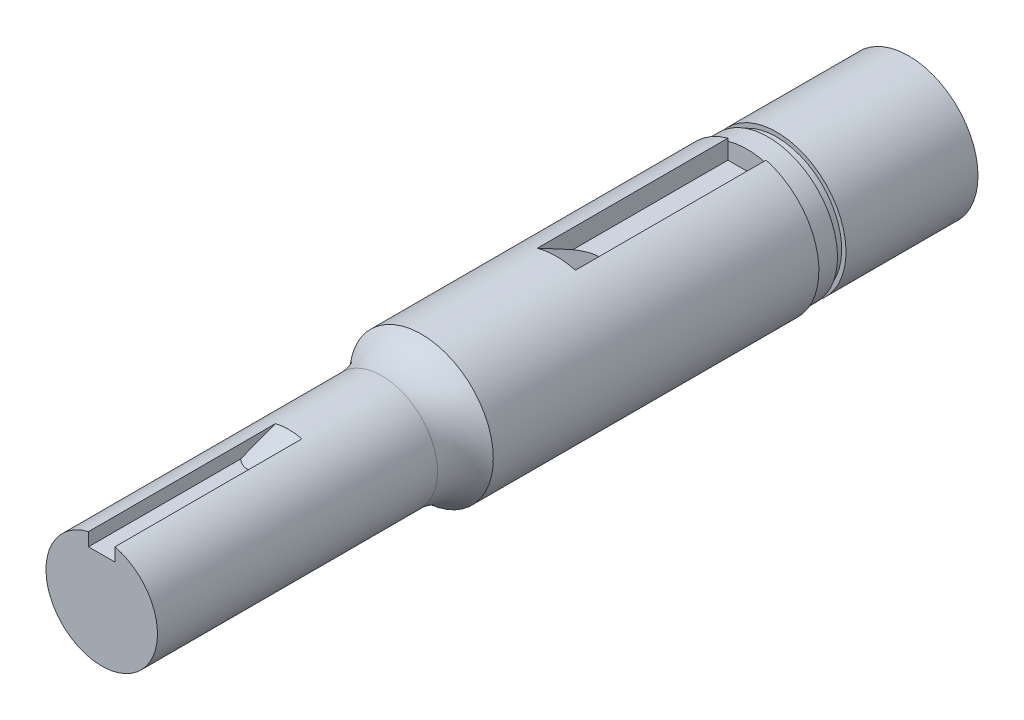
ISO-10303-21;
HEADER;
FILE_DESCRIPTION(('STEP AP214'),'2;1');
FILE_NAME('part.step','',(''),(''),'','','');
FILE_SCHEMA(('AUTOMOTIVE_DESIGN { 1 0 10303 214 1 1 1 1 }'));
ENDSEC;
DATA;
#1=APPLICATION_CONTEXT('core data for automotive mechanical design processes');
#2=APPLICATION_PROTOCOL_DEFINITION('international standard','automotive_design',2000,#1);
#3=PRODUCT_CONTEXT('',#1,'mechanical');
#4=PRODUCT('Part','Part','',(#3));
#5=PRODUCT_RELATED_PRODUCT_CATEGORY('part','',(#4));
#6=PRODUCT_DEFINITION_FORMATION('','',#4);
#7=PRODUCT_DEFINITION_CONTEXT('part definition',#1,'design');
#8=PRODUCT_DEFINITION('design','',#6,#7);
#9=PRODUCT_DEFINITION_SHAPE('','',#8);
#10=(LENGTH_UNIT() NAMED_UNIT(*) SI_UNIT(.MILLI.,.METRE.));
#11=(NAMED_UNIT(*) PLANE_ANGLE_UNIT() SI_UNIT($,.RADIAN.));
#12=(NAMED_UNIT(*) SI_UNIT($,.STERADIAN.) SOLID_ANGLE_UNIT());
#13=UNCERTAINTY_MEASURE_WITH_UNIT(LENGTH_MEASURE(1.E-05),#10,'distance_accuracy_value','');
#14=(GEOMETRIC_REPRESENTATION_CONTEXT(3) GLOBAL_UNCERTAINTY_ASSIGNED_CONTEXT((#13)) GLOBAL_UNIT_ASSIGNED_CONTEXT((#10,
#11,#12)) REPRESENTATION_CONTEXT('',''));
#15=CARTESIAN_POINT('',(0.,0.,0.));
#16=DIRECTION('',(0.,0.,1.));
#17=DIRECTION('',(1.,0.,0.));
#18=AXIS2_PLACEMENT_3D('',#15,#16,#17);
#19=CARTESIAN_POINT('',(0.,0.,28.194));
#20=DIRECTION('',(0.,0.,-1.));
#21=DIRECTION('',(-1.,0.,0.));
#22=AXIS2_PLACEMENT_3D('',#19,#20,#21);
#23=CYLINDRICAL_SURFACE('',#22,6.223);
#24=DIRECTION('',(0.,0.,-1.));
#25=VECTOR('',#24,1.);
#26=CARTESIAN_POINT('',(1.651,5.999993999997,28.194));
#27=LINE('',#26,#25);
#28=CARTESIAN_POINT('',(1.651,5.999993999997,0.));
#29=VERTEX_POINT('',#28);
#30=CARTESIAN_POINT('',(1.651,5.999993999997,16.51));
#31=VERTEX_POINT('',#30);
#32=EDGE_CURVE('E173',#29,#31,#27,.F.);
#33=ORIENTED_EDGE('',*,*,#32,.T.);
#34=CARTESIAN_POINT('',(0.,0.,16.51));
#35=DIRECTION('',(0.,0.,-1.));
#36=DIRECTION('',(-1.,0.,0.));
#37=AXIS2_PLACEMENT_3D('',#34,#35,#36);
#38=CIRCLE('',#37,6.223);
#39=CARTESIAN_POINT('',(-1.651,5.999993999997,16.51));
#40=VERTEX_POINT('',#39);
#41=EDGE_CURVE('E309',#31,#40,#38,.F.);
#42=ORIENTED_EDGE('',*,*,#41,.T.);
#43=DIRECTION('',(0.,0.,-1.));
#44=VECTOR('',#43,1.);
#45=CARTESIAN_POINT('',(-1.651,5.999993999997,28.194));
#46=LINE('',#45,#44);
#47=CARTESIAN_POINT('',(-1.651,5.999993999997,0.));
#48=VERTEX_POINT('',#47);
#49=EDGE_CURVE('E170',#40,#48,#46,.T.);
#50=ORIENTED_EDGE('',*,*,#49,.T.);
#51=CARTESIAN_POINT('',(0.,0.,0.));
#52=DIRECTION('',(0.,0.,1.));
#53=DIRECTION('',(1.,0.,0.));
#54=AXIS2_PLACEMENT_3D('',#51,#52,#53);
#55=CIRCLE('',#54,6.223);
#56=EDGE_CURVE('E128',#48,#29,#55,.T.);
#57=ORIENTED_EDGE('',*,*,#56,.T.);
#58=EDGE_LOOP('',(#33,#42,#50,#57));
#59=FACE_BOUND('',#58,.T.);
#60=CARTESIAN_POINT('',(0.,0.,28.194));
#61=DIRECTION('',(0.,0.,1.));
#62=DIRECTION('',(1.,0.,0.));
#63=AXIS2_PLACEMENT_3D('',#60,#61,#62);
#64=CIRCLE('',#63,6.223);
#65=CARTESIAN_POINT('',(6.223,0.,28.194));
#66=VERTEX_POINT('',#65);
#67=EDGE_CURVE('E182',#66,#66,#64,.T.);
#68=ORIENTED_EDGE('',*,*,#67,.F.);
#69=EDGE_LOOP('',(#68));
#70=FACE_BOUND('',#69,.T.);
#71=ADVANCED_FACE('F35',(#59,#70),#23,.T.);
#72=CARTESIAN_POINT('',(0.,0.,0.));
#73=DIRECTION('',(0.,0.,1.));
#74=DIRECTION('',(1.,0.,0.));
#75=AXIS2_PLACEMENT_3D('',#72,#73,#74);
#76=PLANE('',#75);
#77=CARTESIAN_POINT('',(0.,0.,0.));
#78=DIRECTION('',(0.,0.,-1.));
#79=DIRECTION('',(0.,1.,0.));
#80=AXIS2_PLACEMENT_3D('',#77,#78,#79);
#81=CIRCLE('',#80,6.);
#82=CARTESIAN_POINT('',(1.651,5.76837923510582,0.));
#83=VERTEX_POINT('',#82);
#84=CARTESIAN_POINT('',(-1.651,5.76837923510582,0.));
#85=VERTEX_POINT('',#84);
#86=EDGE_CURVE('E125',#83,#85,#81,.T.);
#87=ORIENTED_EDGE('',*,*,#86,.F.);
#88=DIRECTION('',(0.,-1.,0.));
#89=VECTOR('',#88,1.);
#90=CARTESIAN_POINT('',(1.651,7.650993999997,0.));
#91=LINE('',#90,#89);
#92=EDGE_CURVE('E166',#29,#83,#91,.T.);
#93=ORIENTED_EDGE('',*,*,#92,.F.);
#94=ORIENTED_EDGE('',*,*,#56,.F.);
#95=DIRECTION('',(0.,1.,0.));
#96=VECTOR('',#95,1.);
#97=CARTESIAN_POINT('',(-1.651,7.650993999997,0.));
#98=LINE('',#97,#96);
#99=EDGE_CURVE('E115',#85,#48,#98,.T.);
#100=ORIENTED_EDGE('',*,*,#99,.F.);
#101=EDGE_LOOP('',(#87,#93,#94,#100));
#102=FACE_BOUND('',#101,.T.);
#103=ADVANCED_FACE('F122',(#102),#76,.F.);
#104=CARTESIAN_POINT('',(0.,0.,23.114));
#105=DIRECTION('',(0.,0.,1.));
#106=DIRECTION('',(1.,0.,0.));
#107=AXIS2_PLACEMENT_3D('',#104,#105,#106);
#108=CYLINDRICAL_SURFACE('',#107,4.826);
#109=CARTESIAN_POINT('',(0.,0.,31.6283661715082));
#110=DIRECTION('',(0.,0.,-1.));
#111=DIRECTION('',(-1.,0.,0.));
#112=AXIS2_PLACEMENT_3D('',#109,#110,#111);
#113=CIRCLE('',#112,4.826);
#114=CARTESIAN_POINT('',(-4.826,0.,31.6283661715082));
#115=VERTEX_POINT('',#114);
#116=EDGE_CURVE('E11',#115,#115,#113,.F.);
#117=ORIENTED_EDGE('',*,*,#116,.T.);
#118=EDGE_LOOP('',(#117));
#119=FACE_BOUND('',#118,.T.);
#120=CARTESIAN_POINT('',(0.,0.,39.6907036772926));
#121=DIRECTION('',(0.,0.,1.));
#122=DIRECTION('',(1.,0.,0.));
#123=AXIS2_PLACEMENT_3D('',#120,#121,#122);
#124=CIRCLE('',#123,4.826);
#125=CARTESIAN_POINT('',(-1.143,4.68869139526158,39.6907036772926));
#126=VERTEX_POINT('',#125);
#127=CARTESIAN_POINT('',(1.143,4.68869139526158,39.6907036772926));
#128=VERTEX_POINT('',#127);
#129=EDGE_CURVE('E185',#126,#128,#124,.F.);
#130=ORIENTED_EDGE('',*,*,#129,.T.);
#131=DIRECTION('',(0.,0.,1.));
#132=VECTOR('',#131,1.);
#133=CARTESIAN_POINT('',(1.143,4.68869139526158,23.114));
#134=LINE('',#133,#132);
#135=CARTESIAN_POINT('',(1.143,4.68869139526158,55.88));
#136=VERTEX_POINT('',#135);
#137=EDGE_CURVE('E175',#136,#128,#134,.F.);
#138=ORIENTED_EDGE('',*,*,#137,.F.);
#139=CARTESIAN_POINT('',(0.,0.,55.88));
#140=DIRECTION('',(0.,0.,1.));
#141=DIRECTION('',(1.,0.,0.));
#142=AXIS2_PLACEMENT_3D('',#139,#140,#141);
#143=CIRCLE('',#142,4.826);
#144=CARTESIAN_POINT('',(-1.143,4.68869139526158,55.88));
#145=VERTEX_POINT('',#144);
#146=EDGE_CURVE('E179',#145,#136,#143,.T.);
#147=ORIENTED_EDGE('',*,*,#146,.F.);
#148=DIRECTION('',(0.,0.,1.));
#149=VECTOR('',#148,1.);
#150=CARTESIAN_POINT('',(-1.143,4.68869139526158,23.114));
#151=LINE('',#150,#149);
#152=EDGE_CURVE('E177',#126,#145,#151,.T.);
#153=ORIENTED_EDGE('',*,*,#152,.F.);
#154=EDGE_LOOP('',(#130,#138,#147,#153));
#155=FACE_BOUND('',#154,.T.);
#156=ADVANCED_FACE('F276',(#119,#155),#108,.T.);
#157=CARTESIAN_POINT('',(0.,0.,55.88));
#158=DIRECTION('',(0.,0.,1.));
#159=DIRECTION('',(1.,0.,0.));
#160=AXIS2_PLACEMENT_3D('',#157,#158,#159);
#161=PLANE('',#160);
#162=DIRECTION('',(0.,-1.,0.));
#163=VECTOR('',#162,1.);
#164=CARTESIAN_POINT('',(-1.143,5.83169139526158,55.88));
#165=LINE('',#164,#163);
#166=CARTESIAN_POINT('',(-1.143,3.54569139526158,55.88));
#167=VERTEX_POINT('',#166);
#168=EDGE_CURVE('E142',#145,#167,#165,.T.);
#169=ORIENTED_EDGE('',*,*,#168,.F.);
#170=ORIENTED_EDGE('',*,*,#146,.T.);
#171=DIRECTION('',(0.,1.,0.));
#172=VECTOR('',#171,1.);
#173=CARTESIAN_POINT('',(1.143,5.83169139526158,55.88));
#174=LINE('',#173,#172);
#175=CARTESIAN_POINT('',(1.143,3.54569139526158,55.88));
#176=VERTEX_POINT('',#175);
#177=EDGE_CURVE('E156',#176,#136,#174,.T.);
#178=ORIENTED_EDGE('',*,*,#177,.F.);
#179=DIRECTION('',(1.,0.,0.));
#180=VECTOR('',#179,1.);
#181=CARTESIAN_POINT('',(-1.143,3.54569139526158,55.88));
#182=LINE('',#181,#180);
#183=EDGE_CURVE('E159',#167,#176,#182,.T.);
#184=ORIENTED_EDGE('',*,*,#183,.F.);
#185=EDGE_LOOP('',(#169,#170,#178,#184));
#186=FACE_BOUND('',#185,.T.);
#187=ADVANCED_FACE('F273',(#186),#161,.T.);
#188=CARTESIAN_POINT('',(1.651,7.650993999997,12.7));
#189=DIRECTION('',(1.,0.,0.));
#190=DIRECTION('',(0.,0.,-1.));
#191=AXIS2_PLACEMENT_3D('',#188,#189,#190);
#192=PLANE('',#191);
#193=ORIENTED_EDGE('',*,*,#92,.T.);
#194=CARTESIAN_POINT('',(1.651,4.348993999997,0.));
#195=VERTEX_POINT('',#194);
#196=EDGE_CURVE('E135',#83,#195,#91,.T.);
#197=ORIENTED_EDGE('',*,*,#196,.T.);
#198=DIRECTION('',(0.,0.,-1.));
#199=VECTOR('',#198,1.);
#200=CARTESIAN_POINT('',(1.651,4.348993999997,12.7));
#201=LINE('',#200,#199);
#202=CARTESIAN_POINT('',(1.651,4.348993999997,13.4264110454169));
#203=VERTEX_POINT('',#202);
#204=EDGE_CURVE('E58',#203,#195,#201,.T.);
#205=ORIENTED_EDGE('',*,*,#204,.F.);
#206=CARTESIAN_POINT('',(1.651,4.348993999997,13.4264110454169));
#207=CARTESIAN_POINT('',(1.651,4.48846788733076,13.6823609357202));
#208=CARTESIAN_POINT('',(1.651,4.62732177659754,13.9386473205925));
#209=CARTESIAN_POINT('',(1.651,4.90402064332714,14.4517610579769));
#210=CARTESIAN_POINT('',(1.651,5.04186563080066,14.7085884050888));
#211=CARTESIAN_POINT('',(1.651,5.31677999377512,15.2226561142071));
#212=CARTESIAN_POINT('',(1.651,5.45384937235951,15.4798964745663));
#213=CARTESIAN_POINT('',(1.651,5.72735836693969,15.9947151032893));
#214=CARTESIAN_POINT('',(1.651,5.86379797670863,16.2522933749619));
#215=CARTESIAN_POINT('',(1.651,5.99999399999702,16.51));
#216=B_SPLINE_CURVE_WITH_KNOTS('',3,(#206,#207,#208,#209,#210,#211,#212,#213,#214,#215),
.UNSPECIFIED.,.F.,.F.,(4,2,2,2,4),(0.,0.874451443988116,1.74889419954307,2.62333347629737,
3.49778138066095),.UNSPECIFIED.);
#217=EDGE_CURVE('E259',#203,#31,#216,.T.);
#218=ORIENTED_EDGE('',*,*,#217,.T.);
#219=ORIENTED_EDGE('',*,*,#32,.F.);
#220=EDGE_LOOP('',(#193,#197,#205,#218,#219));
#221=FACE_BOUND('',#220,.T.);
#222=ADVANCED_FACE('F251',(#221),#192,.F.);
#223=CARTESIAN_POINT('',(-1.651,7.650993999997,12.7));
#224=DIRECTION('',(-1.,0.,0.));
#225=DIRECTION('',(0.,-1.,0.));
#226=AXIS2_PLACEMENT_3D('',#223,#224,#225);
#227=PLANE('',#226);
#228=ORIENTED_EDGE('',*,*,#49,.F.);
#229=CARTESIAN_POINT('',(-1.651,5.999993999997,16.51));
#230=CARTESIAN_POINT('',(-1.651,5.86379797670861,16.2522933749619));
#231=CARTESIAN_POINT('',(-1.651,5.72735836693969,15.9947151032893));
#232=CARTESIAN_POINT('',(-1.651,5.45384937235951,15.4798964745663));
#233=CARTESIAN_POINT('',(-1.651,5.31677999377513,15.2226561142071));
#234=CARTESIAN_POINT('',(-1.651,5.04186563080065,14.7085884050888));
#235=CARTESIAN_POINT('',(-1.651,4.90402064332713,14.4517610579769));
#236=CARTESIAN_POINT('',(-1.651,4.62732177659755,13.9386473205924));
#237=CARTESIAN_POINT('',(-1.651,4.4884678873308,13.6823609357202));
#238=CARTESIAN_POINT('',(-1.651,4.34899399999711,13.4264110454168));
#239=B_SPLINE_CURVE_WITH_KNOTS('',3,(#229,#230,#231,#232,#233,#234,#235,#236,#237,#238),
.UNSPECIFIED.,.F.,.F.,(4,2,2,2,4),(0.,0.874447904363581,1.74888718111788,2.62332993667283,
3.49778138066095),.UNSPECIFIED.);
#240=CARTESIAN_POINT('',(-1.651,4.348993999997,13.4264110454169));
#241=VERTEX_POINT('',#240);
#242=EDGE_CURVE('E43',#40,#241,#239,.T.);
#243=ORIENTED_EDGE('',*,*,#242,.T.);
#244=DIRECTION('',(0.,0.,-1.));
#245=VECTOR('',#244,1.);
#246=CARTESIAN_POINT('',(-1.651,4.348993999997,12.7));
#247=LINE('',#246,#245);
#248=CARTESIAN_POINT('',(-1.651,4.348993999997,0.));
#249=VERTEX_POINT('',#248);
#250=EDGE_CURVE('E50',#241,#249,#247,.T.);
#251=ORIENTED_EDGE('',*,*,#250,.T.);
#252=EDGE_CURVE('E112',#249,#85,#98,.T.);
#253=ORIENTED_EDGE('',*,*,#252,.T.);
#254=ORIENTED_EDGE('',*,*,#99,.T.);
#255=EDGE_LOOP('',(#228,#243,#251,#253,#254));
#256=FACE_BOUND('',#255,.T.);
#257=ADVANCED_FACE('F114',(#256),#227,.F.);
#258=CARTESIAN_POINT('',(1.651,4.348993999997,12.7));
#259=DIRECTION('',(0.,-1.,0.));
#260=DIRECTION('',(1.,0.,0.));
#261=AXIS2_PLACEMENT_3D('',#258,#259,#260);
#262=PLANE('',#261);
#263=DIRECTION('',(-1.,0.,0.));
#264=VECTOR('',#263,1.);
#265=CARTESIAN_POINT('',(1.651,4.348993999997,0.));
#266=LINE('',#265,#264);
#267=EDGE_CURVE('E130',#195,#249,#266,.T.);
#268=ORIENTED_EDGE('',*,*,#267,.T.);
#269=ORIENTED_EDGE('',*,*,#250,.F.);
#270=CARTESIAN_POINT('',(-1.651,4.348993999997,13.4264110454169));
#271=CARTESIAN_POINT('',(-1.58225453370753,4.348993999997,13.3785523534828));
#272=CARTESIAN_POINT('',(-1.51231347373836,4.348993999997,13.3324238638544));
#273=CARTESIAN_POINT('',(-1.36963767788203,4.348993999997,13.2443331821572));
#274=CARTESIAN_POINT('',(-1.29689677320872,4.348993999997,13.2023810176708));
#275=CARTESIAN_POINT('',(-1.07272320173922,4.348993999997,13.0833115356545));
#276=CARTESIAN_POINT('',(-0.916849121790067,4.348993999997,13.0140773063389));
#277=CARTESIAN_POINT('',(-0.63076934235147,4.348993999997,12.9179997481844));
#278=CARTESIAN_POINT('',(-0.502643413856108,4.348993999997,12.8851326076442));
#279=CARTESIAN_POINT('',(-0.308073905823448,4.348993999997,12.8525036538333));
#280=CARTESIAN_POINT('',(-0.242982998479485,4.348993999997,12.8444055771709));
#281=CARTESIAN_POINT('',(-0.112353616722489,4.348993999997,12.8339458488045));
#282=CARTESIAN_POINT('',(-0.0468153150572626,4.348993999997,12.8315820961202));
#283=CARTESIAN_POINT('',(0.0899279452130216,4.348993999997,12.8327361991778));
#284=CARTESIAN_POINT('',(0.161128830405412,4.348993999997,12.8367847552696));
#285=CARTESIAN_POINT('',(0.302873778504621,4.348993999997,12.85160018547));
#286=CARTESIAN_POINT('',(0.373417248307868,4.348993999997,12.8623726233864));
#287=CARTESIAN_POINT('',(0.53261524001256,4.348993999997,12.8940616858492));
#288=CARTESIAN_POINT('',(0.62087652198538,4.348993999997,12.9169611478853));
#289=CARTESIAN_POINT('',(0.794623208606191,4.348993999997,12.9717241484514));
#290=CARTESIAN_POINT('',(0.880105487169831,4.348993999997,13.0035974171479));
#291=CARTESIAN_POINT('',(1.04812252161062,4.348993999997,13.0749551470513));
#292=CARTESIAN_POINT('',(1.13064671680426,4.348993999997,13.1144641734151));
#293=CARTESIAN_POINT('',(1.29237453567966,4.348993999997,13.1996420180998));
#294=CARTESIAN_POINT('',(1.37157973832689,4.348993999997,13.2453078627688));
#295=CARTESIAN_POINT('',(1.4835146191288,4.348993999997,13.314759311475));
#296=CARTESIAN_POINT('',(1.51751402415629,4.348993999997,13.3365340249646));
#297=CARTESIAN_POINT('',(1.58476707570861,4.348993999997,13.3808773862698));
#298=CARTESIAN_POINT('',(1.61802343564025,4.348993999997,13.4034419158464));
#299=CARTESIAN_POINT('',(1.65100000000007,4.348993999997,13.4264110454167));
#300=B_SPLINE_CURVE_WITH_KNOTS('',3,(#270,#271,#272,#273,#274,#275,#276,#277,#278,#279,#280,
#281,#282,#283,#284,#285,#286,#287,#288,#289,#290,#291,#292,#293,#294,#295,#296,#297,#298,#299),
.UNSPECIFIED.,.F.,.F.,(4,2,2,2,2,2,2,2,2,2,2,2,2,2,4),(0.,0.251224786263539,0.503038921237151,
1.01222457430827,1.40725642840742,1.60381154406156,1.80029463364816,2.01390638141137,
2.22769512116054,2.50067551231565,2.77395303959782,3.04812482581317,3.32216466235948,
3.44327741128553,3.56383238529176),.UNSPECIFIED.);
#301=EDGE_CURVE('E265',#241,#203,#300,.T.);
#302=ORIENTED_EDGE('',*,*,#301,.T.);
#303=ORIENTED_EDGE('',*,*,#204,.T.);
#304=EDGE_LOOP('',(#268,#269,#302,#303));
#305=FACE_BOUND('',#304,.T.);
#306=ADVANCED_FACE('F246',(#305),#262,.F.);
#307=CARTESIAN_POINT('',(-1.143,5.83169139526158,43.18));
#308=DIRECTION('',(-1.,0.,0.));
#309=DIRECTION('',(0.,0.,1.));
#310=AXIS2_PLACEMENT_3D('',#307,#308,#309);
#311=PLANE('',#310);
#312=ORIENTED_EDGE('',*,*,#152,.T.);
#313=ORIENTED_EDGE('',*,*,#168,.T.);
#314=DIRECTION('',(0.,0.,1.));
#315=VECTOR('',#314,1.);
#316=CARTESIAN_POINT('',(-1.143,3.54569139526158,43.18));
#317=LINE('',#316,#315);
#318=CARTESIAN_POINT('',(-1.143,3.54569139526158,42.714661654614));
#319=VERTEX_POINT('',#318);
#320=EDGE_CURVE('E155',#319,#167,#317,.T.);
#321=ORIENTED_EDGE('',*,*,#320,.F.);
#322=CARTESIAN_POINT('',(-1.143,3.54569139526158,42.714661654614));
#323=CARTESIAN_POINT('',(-1.143,3.64191107121545,42.4630325438296));
#324=CARTESIAN_POINT('',(-1.143,3.73782137054963,42.2112854103567));
#325=CARTESIAN_POINT('',(-1.143,3.92912797649702,41.7075966936562));
#326=CARTESIAN_POINT('',(-1.143,4.02452428455673,41.4556551109781));
#327=CARTESIAN_POINT('',(-1.143,4.21490811352426,40.951617927151));
#328=CARTESIAN_POINT('',(-1.143,4.30989563484261,40.699522326157));
#329=CARTESIAN_POINT('',(-1.143,4.49953107699278,40.1952026026246));
#330=CARTESIAN_POINT('',(-1.143,4.59417899687224,39.942978479728));
#331=CARTESIAN_POINT('',(-1.143,4.68869139526158,39.6907036772926));
#332=B_SPLINE_CURVE_WITH_KNOTS('',3,(#322,#323,#324,#325,#326,#327,#328,#329,#330,#331),
.UNSPECIFIED.,.F.,.F.,(4,2,2,2,4),(0.,0.808194275469189,1.61638627530359,2.42457746332538,
3.232770916051),.UNSPECIFIED.);
#333=EDGE_CURVE('E229',#319,#126,#332,.T.);
#334=ORIENTED_EDGE('',*,*,#333,.T.);
#335=EDGE_LOOP('',(#312,#313,#321,#334));
#336=FACE_BOUND('',#335,.T.);
#337=ADVANCED_FACE('F241',(#336),#311,.F.);
#338=CARTESIAN_POINT('',(1.143,5.83169139526158,43.18));
#339=DIRECTION('',(1.,0.,0.));
#340=DIRECTION('',(0.,1.,0.));
#341=AXIS2_PLACEMENT_3D('',#338,#339,#340);
#342=PLANE('',#341);
#343=ORIENTED_EDGE('',*,*,#137,.T.);
#344=CARTESIAN_POINT('',(1.143,4.68869139526158,39.6907036772926));
#345=CARTESIAN_POINT('',(1.143,4.59417899687224,39.942978479728));
#346=CARTESIAN_POINT('',(1.143,4.49953107699278,40.1952026026246));
#347=CARTESIAN_POINT('',(1.143,4.30989563484261,40.699522326157));
#348=CARTESIAN_POINT('',(1.143,4.21490811352426,40.951617927151));
#349=CARTESIAN_POINT('',(1.143,4.02452428455673,41.4556551109781));
#350=CARTESIAN_POINT('',(1.143,3.92912797649702,41.7075966936562));
#351=CARTESIAN_POINT('',(1.143,3.73782137054963,42.2112854103567));
#352=CARTESIAN_POINT('',(1.143,3.64191107121545,42.4630325438296));
#353=CARTESIAN_POINT('',(1.143,3.54569139526159,42.714661654614));
#354=B_SPLINE_CURVE_WITH_KNOTS('',3,(#344,#345,#346,#347,#348,#349,#350,#351,#352,#353),
.UNSPECIFIED.,.F.,.F.,(4,2,2,2,4),(0.,0.80819345272561,1.61638464074741,2.4245766405818,
3.232770916051),.UNSPECIFIED.);
#355=CARTESIAN_POINT('',(1.143,3.54569139526158,42.714661654614));
#356=VERTEX_POINT('',#355);
#357=EDGE_CURVE('E191',#128,#356,#354,.T.);
#358=ORIENTED_EDGE('',*,*,#357,.T.);
#359=DIRECTION('',(0.,0.,1.));
#360=VECTOR('',#359,1.);
#361=CARTESIAN_POINT('',(1.143,3.54569139526158,43.18));
#362=LINE('',#361,#360);
#363=EDGE_CURVE('E163',#356,#176,#362,.T.);
#364=ORIENTED_EDGE('',*,*,#363,.T.);
#365=ORIENTED_EDGE('',*,*,#177,.T.);
#366=EDGE_LOOP('',(#343,#358,#364,#365));
#367=FACE_BOUND('',#366,.T.);
#368=ADVANCED_FACE('F207',(#367),#342,.F.);
#369=CARTESIAN_POINT('',(-1.143,3.54569139526158,43.18));
#370=DIRECTION('',(0.,-1.,0.));
#371=DIRECTION('',(0.,0.,-1.));
#372=AXIS2_PLACEMENT_3D('',#369,#370,#371);
#373=PLANE('',#372);
#374=ORIENTED_EDGE('',*,*,#183,.T.);
#375=ORIENTED_EDGE('',*,*,#363,.F.);
#376=CARTESIAN_POINT('',(1.143,3.54569139526158,42.714661654614));
#377=CARTESIAN_POINT('',(1.09906619066083,3.54569139526158,42.751668477797));
#378=CARTESIAN_POINT('',(1.05421753422614,3.54569139526158,42.7875663733998));
#379=CARTESIAN_POINT('',(0.96228026698028,3.54569139526158,42.8566753515232));
#380=CARTESIAN_POINT('',(0.915184991753097,3.54569139526158,42.8898775345863));
#381=CARTESIAN_POINT('',(0.77271758521915,3.54569139526158,42.9828336606464));
#382=CARTESIAN_POINT('',(0.674015035604103,3.54569139526158,43.0378210009758));
#383=CARTESIAN_POINT('',(0.522913655162584,3.54569139526158,43.1038107669882));
#384=CARTESIAN_POINT('',(0.473907860702112,3.54569139526158,43.1226277453968));
#385=CARTESIAN_POINT('',(0.373711587842192,3.54569139526158,43.1553318586691));
#386=CARTESIAN_POINT('',(0.32250340264526,3.54569139526158,43.169164364498));
#387=CARTESIAN_POINT('',(0.27057074780532,3.54569139526158,43.18));
#388=B_SPLINE_CURVE_WITH_KNOTS('',3,(#376,#377,#378,#379,#380,#381,#382,#383,#384,#385,#386,
#387),.UNSPECIFIED.,.F.,.F.,(4,2,2,2,2,4),(0.,0.172261192317813,0.34506972481255,
0.682168346987202,0.839406984123873,0.998319974773682),.UNSPECIFIED.);
#389=CARTESIAN_POINT('',(0.270570747805321,3.54569139526158,43.18));
#390=VERTEX_POINT('',#389);
#391=EDGE_CURVE('E200',#356,#390,#388,.T.);
#392=ORIENTED_EDGE('',*,*,#391,.T.);
#393=DIRECTION('',(1.,0.,0.));
#394=VECTOR('',#393,1.);
#395=CARTESIAN_POINT('',(-1.143,3.54569139526158,43.18));
#396=LINE('',#395,#394);
#397=CARTESIAN_POINT('',(-0.270570747805321,3.54569139526158,43.18));
#398=VERTEX_POINT('',#397);
#399=EDGE_CURVE('E152',#398,#390,#396,.T.);
#400=ORIENTED_EDGE('',*,*,#399,.F.);
#401=CARTESIAN_POINT('',(-0.270570747805321,3.54569139526158,43.18));
#402=CARTESIAN_POINT('',(-0.383470605640541,3.54569139526158,43.1563632454408));
#403=CARTESIAN_POINT('',(-0.492089095095955,3.54569139526158,43.1189880542568));
#404=CARTESIAN_POINT('',(-0.698491261252879,3.54569139526158,43.0249721934017));
#405=CARTESIAN_POINT('',(-0.796435984494412,3.54569139526158,42.9686940314478));
#406=CARTESIAN_POINT('',(-0.933730160196789,3.54569139526158,42.8768736131121));
#407=CARTESIAN_POINT('',(-0.97658108001734,3.54569139526158,42.8461854254401));
#408=CARTESIAN_POINT('',(-1.06089031740329,3.54569139526158,42.7822192749869));
#409=CARTESIAN_POINT('',(-1.10233354799094,3.54569139526158,42.7489213666839));
#410=CARTESIAN_POINT('',(-1.143,3.54569139526158,42.714661654614));
#411=B_SPLINE_CURVE_WITH_KNOTS('',3,(#401,#402,#403,#404,#405,#406,#407,#408,#409,#410),
.UNSPECIFIED.,.F.,.F.,(4,2,2,2,4),(0.,0.343249029384977,0.680259316672278,0.838346607600622,
0.997789092686463),.UNSPECIFIED.);
#412=EDGE_CURVE('E223',#398,#319,#411,.T.);
#413=ORIENTED_EDGE('',*,*,#412,.T.);
#414=ORIENTED_EDGE('',*,*,#320,.T.);
#415=EDGE_LOOP('',(#374,#375,#392,#400,#413,#414));
#416=FACE_BOUND('',#415,.T.);
#417=ADVANCED_FACE('F236',(#416),#373,.F.);
#418=CARTESIAN_POINT('',(0.,0.,43.18));
#419=DIRECTION('',(0.,0.,1.));
#420=DIRECTION('',(1.,0.,0.));
#421=AXIS2_PLACEMENT_3D('',#418,#419,#420);
#422=PLANE('',#421);
#423=ORIENTED_EDGE('',*,*,#399,.T.);
#424=CARTESIAN_POINT('',(0.,0.,43.18));
#425=DIRECTION('',(0.,0.,1.));
#426=DIRECTION('',(1.,0.,0.));
#427=AXIS2_PLACEMENT_3D('',#424,#425,#426);
#428=CIRCLE('',#427,3.55599999999999);
#429=EDGE_CURVE('E189',#390,#398,#428,.T.);
#430=ORIENTED_EDGE('',*,*,#429,.T.);
#431=EDGE_LOOP('',(#423,#430));
#432=FACE_BOUND('',#431,.T.);
#433=ADVANCED_FACE('F239',(#432),#422,.T.);
#434=CARTESIAN_POINT('',(0.,1.46642216231412E-13,-14.));
#435=DIRECTION('',(0.,0.,1.));
#436=DIRECTION('',(0.,-1.,0.));
#437=AXIS2_PLACEMENT_3D('',#434,#435,#436);
#438=CYLINDRICAL_SURFACE('',#437,6.);
#439=CARTESIAN_POINT('',(0.,0.,-1.8334));
#440=DIRECTION('',(0.,0.,1.));
#441=DIRECTION('',(0.,-1.,0.));
#442=AXIS2_PLACEMENT_3D('',#439,#440,#441);
#443=CIRCLE('',#442,6.);
#444=CARTESIAN_POINT('',(0.,-5.99999999999998,-1.83340000000006));
#445=VERTEX_POINT('',#444);
#446=EDGE_CURVE('E137',#445,#445,#443,.T.);
#447=ORIENTED_EDGE('',*,*,#446,.T.);
#448=EDGE_LOOP('',(#447));
#449=FACE_BOUND('',#448,.T.);
#450=ORIENTED_EDGE('',*,*,#86,.T.);
#451=EDGE_CURVE('E133',#85,#83,#81,.T.);
#452=ORIENTED_EDGE('',*,*,#451,.T.);
#453=EDGE_LOOP('',(#450,#452));
#454=FACE_BOUND('',#453,.T.);
#455=ADVANCED_FACE('F139',(#449,#454),#438,.T.);
#456=CARTESIAN_POINT('',(0.,0.,0.));
#457=DIRECTION('',(0.,0.,-1.));
#458=DIRECTION('',(0.,1.,0.));
#459=AXIS2_PLACEMENT_3D('',#456,#457,#458);
#460=PLANE('',#459);
#461=ORIENTED_EDGE('',*,*,#196,.F.);
#462=ORIENTED_EDGE('',*,*,#451,.F.);
#463=ORIENTED_EDGE('',*,*,#252,.F.);
#464=ORIENTED_EDGE('',*,*,#267,.F.);
#465=EDGE_LOOP('',(#461,#462,#463,#464));
#466=FACE_BOUND('',#465,.T.);
#467=ADVANCED_FACE('F134',(#466),#460,.F.);
#468=CARTESIAN_POINT('',(0.,0.,-1.8334));
#469=DIRECTION('',(0.,0.,1.));
#470=DIRECTION('',(0.,-1.,0.));
#471=AXIS2_PLACEMENT_3D('',#468,#469,#470);
#472=PLANE('',#471);
#473=CARTESIAN_POINT('',(0.,0.,-1.8334));
#474=DIRECTION('',(0.,0.,-1.));
#475=DIRECTION('',(0.,1.,0.));
#476=AXIS2_PLACEMENT_3D('',#473,#474,#475);
#477=CIRCLE('',#476,5.6261);
#478=CARTESIAN_POINT('',(0.,5.62610000000002,-1.83339999999994));
#479=VERTEX_POINT('',#478);
#480=EDGE_CURVE('E149',#479,#479,#477,.T.);
#481=ORIENTED_EDGE('',*,*,#480,.F.);
#482=EDGE_LOOP('',(#481));
#483=FACE_BOUND('',#482,.T.);
#484=ORIENTED_EDGE('',*,*,#446,.F.);
#485=EDGE_LOOP('',(#484));
#486=FACE_BOUND('',#485,.T.);
#487=ADVANCED_FACE('F373',(#483,#486),#472,.F.);
#488=CARTESIAN_POINT('',(0.,0.,-2.57));
#489=DIRECTION('',(0.,0.,1.));
#490=DIRECTION('',(0.,-1.,0.));
#491=AXIS2_PLACEMENT_3D('',#488,#489,#490);
#492=PLANE('',#491);
#493=CARTESIAN_POINT('',(0.,0.,-2.57));
#494=DIRECTION('',(0.,0.,-1.));
#495=DIRECTION('',(0.,1.,0.));
#496=AXIS2_PLACEMENT_3D('',#493,#494,#495);
#497=CIRCLE('',#496,5.6261);
#498=CARTESIAN_POINT('',(0.,5.62610000000003,-2.56999999999994));
#499=VERTEX_POINT('',#498);
#500=EDGE_CURVE('E484',#499,#499,#497,.T.);
#501=ORIENTED_EDGE('',*,*,#500,.T.);
#502=EDGE_LOOP('',(#501));
#503=FACE_BOUND('',#502,.T.);
#504=CARTESIAN_POINT('',(0.,0.,-2.57));
#505=DIRECTION('',(0.,0.,1.));
#506=DIRECTION('',(0.,-1.,0.));
#507=AXIS2_PLACEMENT_3D('',#504,#505,#506);
#508=CIRCLE('',#507,6.);
#509=CARTESIAN_POINT('',(0.,-5.99999999999997,-2.57000000000006));
#510=VERTEX_POINT('',#509);
#511=EDGE_CURVE('E146',#510,#510,#508,.T.);
#512=ORIENTED_EDGE('',*,*,#511,.T.);
#513=EDGE_LOOP('',(#512));
#514=FACE_BOUND('',#513,.T.);
#515=ADVANCED_FACE('F383',(#503,#514),#492,.T.);
#516=CARTESIAN_POINT('',(0.,0.,-1.8334));
#517=DIRECTION('',(0.,0.,-1.));
#518=DIRECTION('',(0.,1.,0.));
#519=AXIS2_PLACEMENT_3D('',#516,#517,#518);
#520=CYLINDRICAL_SURFACE('',#519,5.6261);
#521=ORIENTED_EDGE('',*,*,#480,.T.);
#522=EDGE_LOOP('',(#521));
#523=FACE_BOUND('',#522,.T.);
#524=ORIENTED_EDGE('',*,*,#500,.F.);
#525=EDGE_LOOP('',(#524));
#526=FACE_BOUND('',#525,.T.);
#527=ADVANCED_FACE('F394',(#523,#526),#520,.T.);
#528=CARTESIAN_POINT('',(0.,1.46642216231412E-13,-14.));
#529=DIRECTION('',(0.,0.,-1.));
#530=DIRECTION('',(0.,1.,0.));
#531=AXIS2_PLACEMENT_3D('',#528,#529,#530);
#532=PLANE('',#531);
#533=CARTESIAN_POINT('',(0.,1.46642216231412E-13,-14.));
#534=DIRECTION('',(0.,0.,-1.));
#535=DIRECTION('',(0.,1.,0.));
#536=AXIS2_PLACEMENT_3D('',#533,#534,#535);
#537=CIRCLE('',#536,6.);
#538=CARTESIAN_POINT('',(0.,6.00000000000015,-13.9999999999999));
#539=VERTEX_POINT('',#538);
#540=EDGE_CURVE('E140',#539,#539,#537,.T.);
#541=ORIENTED_EDGE('',*,*,#540,.T.);
#542=EDGE_LOOP('',(#541));
#543=FACE_BOUND('',#542,.T.);
#544=ADVANCED_FACE('F405',(#543),#532,.T.);
#545=ORIENTED_EDGE('',*,*,#540,.F.);
#546=EDGE_LOOP('',(#545));
#547=FACE_BOUND('',#546,.T.);
#548=ORIENTED_EDGE('',*,*,#511,.F.);
#549=EDGE_LOOP('',(#548));
#550=FACE_BOUND('',#549,.T.);
#551=ADVANCED_FACE('F215',(#547,#550),#438,.T.);
#552=CARTESIAN_POINT('',(0.,0.,39.6907036772926));
#553=DIRECTION('',(0.,0.,-1.));
#554=DIRECTION('',(-1.,0.,0.));
#555=AXIS2_PLACEMENT_3D('',#552,#553,#554);
#556=CONICAL_SURFACE('',#555,4.826,0.349065850398869);
#557=ORIENTED_EDGE('',*,*,#412,.F.);
#558=ORIENTED_EDGE('',*,*,#429,.F.);
#559=ORIENTED_EDGE('',*,*,#391,.F.);
#560=ORIENTED_EDGE('',*,*,#357,.F.);
#561=ORIENTED_EDGE('',*,*,#129,.F.);
#562=ORIENTED_EDGE('',*,*,#333,.F.);
#563=EDGE_LOOP('',(#557,#558,#559,#560,#561,#562));
#564=FACE_BOUND('',#563,.T.);
#565=ADVANCED_FACE('F210',(#564),#556,.T.);
#566=CARTESIAN_POINT('',(0.,0.,12.7));
#567=DIRECTION('',(0.,0.,1.));
#568=DIRECTION('',(1.,0.,0.));
#569=AXIS2_PLACEMENT_3D('',#566,#567,#568);
#570=CONICAL_SURFACE('',#569,4.28170803742619,0.471238898038476);
#571=ORIENTED_EDGE('',*,*,#242,.F.);
#572=ORIENTED_EDGE('',*,*,#41,.F.);
#573=ORIENTED_EDGE('',*,*,#217,.F.);
#574=ORIENTED_EDGE('',*,*,#301,.F.);
#575=EDGE_LOOP('',(#571,#572,#573,#574));
#576=FACE_BOUND('',#575,.T.);
#577=ADVANCED_FACE('F214',(#576),#570,.T.);
#578=CARTESIAN_POINT('',(0.,0.,31.6283661715082));
#579=DIRECTION('',(0.,0.,-1.));
#580=DIRECTION('',(-1.,0.,0.));
#581=AXIS2_PLACEMENT_3D('',#578,#579,#580);
#582=TOROIDAL_SURFACE('',#581,9.746,4.92);
#583=ORIENTED_EDGE('',*,*,#67,.T.);
#584=EDGE_LOOP('',(#583));
#585=FACE_BOUND('',#584,.T.);
#586=ORIENTED_EDGE('',*,*,#116,.F.);
#587=EDGE_LOOP('',(#586));
#588=FACE_BOUND('',#587,.T.);
#589=ADVANCED_FACE('F37',(#585,#588),#582,.F.);
#590=CLOSED_SHELL('',(#71,#103,#156,#187,#222,#257,#306,#337,#368,#417,#433,#455,#467,#487,#515,
#527,#544,#551,#565,#577,#589));
#591=MANIFOLD_SOLID_BREP('B2',#590);
#592=ADVANCED_BREP_SHAPE_REPRESENTATION('',(#18,#591),#14);
#593=SHAPE_DEFINITION_REPRESENTATION(#9,#592);
ENDSEC;
END-ISO-10303-21;
